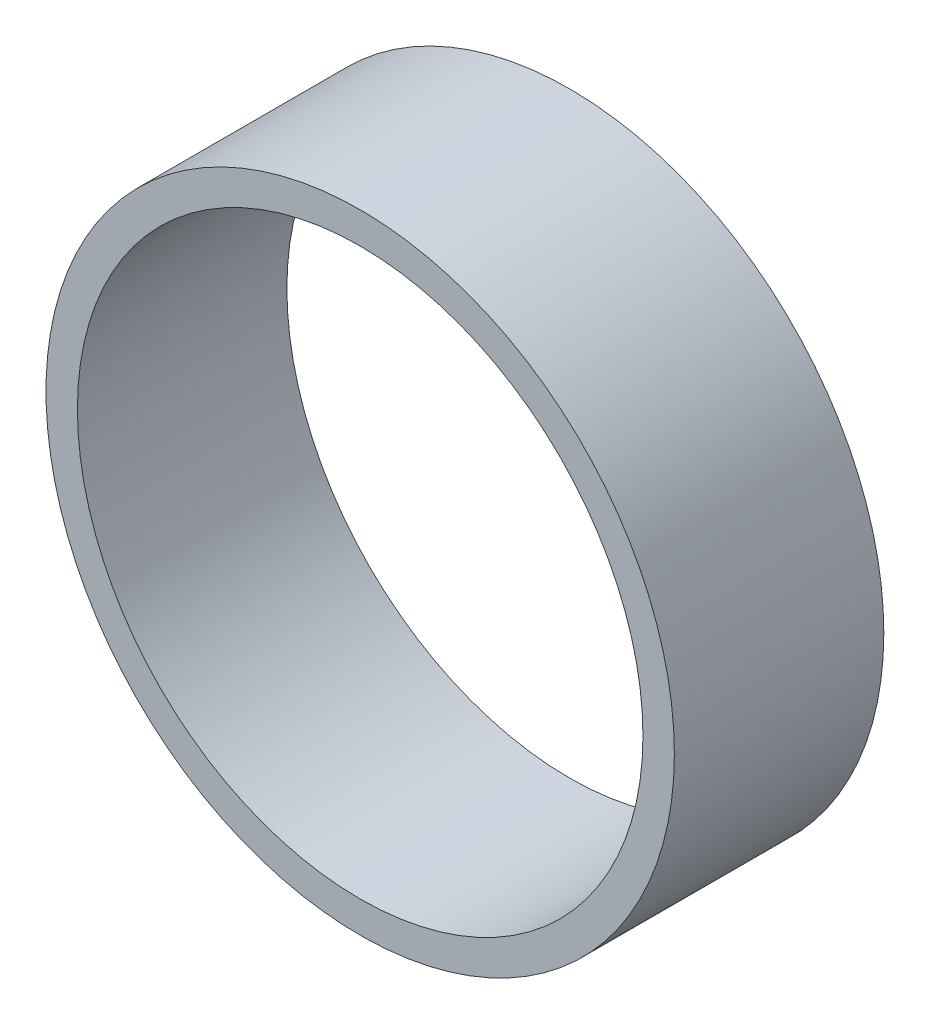
ISO-10303-21;
HEADER;
FILE_DESCRIPTION(('STEP AP214'),'2;1');
FILE_NAME('part.step','',(''),(''),'','','');
FILE_SCHEMA(('AUTOMOTIVE_DESIGN { 1 0 10303 214 1 1 1 1 }'));
ENDSEC;
DATA;
#1=APPLICATION_CONTEXT('core data for automotive mechanical design processes');
#2=APPLICATION_PROTOCOL_DEFINITION('international standard','automotive_design',2000,#1);
#3=PRODUCT_CONTEXT('',#1,'mechanical');
#4=PRODUCT('Part','Part','',(#3));
#5=PRODUCT_RELATED_PRODUCT_CATEGORY('part','',(#4));
#6=PRODUCT_DEFINITION_FORMATION('','',#4);
#7=PRODUCT_DEFINITION_CONTEXT('part definition',#1,'design');
#8=PRODUCT_DEFINITION('design','',#6,#7);
#9=PRODUCT_DEFINITION_SHAPE('','',#8);
#10=(LENGTH_UNIT() NAMED_UNIT(*) SI_UNIT(.MILLI.,.METRE.));
#11=(NAMED_UNIT(*) PLANE_ANGLE_UNIT() SI_UNIT($,.RADIAN.));
#12=(NAMED_UNIT(*) SI_UNIT($,.STERADIAN.) SOLID_ANGLE_UNIT());
#13=UNCERTAINTY_MEASURE_WITH_UNIT(LENGTH_MEASURE(1.E-05),#10,'distance_accuracy_value','');
#14=(GEOMETRIC_REPRESENTATION_CONTEXT(3) GLOBAL_UNCERTAINTY_ASSIGNED_CONTEXT((#13)) GLOBAL_UNIT_ASSIGNED_CONTEXT((#10,
#11,#12)) REPRESENTATION_CONTEXT('',''));
#15=CARTESIAN_POINT('',(0.,0.,0.));
#16=DIRECTION('',(0.,0.,1.));
#17=DIRECTION('',(1.,0.,0.));
#18=AXIS2_PLACEMENT_3D('',#15,#16,#17);
#19=CARTESIAN_POINT('',(0.,0.,20.));
#20=DIRECTION('',(0.,0.,1.));
#21=DIRECTION('',(1.,0.,0.));
#22=AXIS2_PLACEMENT_3D('',#19,#20,#21);
#23=PLANE('',#22);
#24=CARTESIAN_POINT('',(0.,0.,20.));
#25=DIRECTION('',(0.,0.,1.));
#26=DIRECTION('',(1.,0.,0.));
#27=AXIS2_PLACEMENT_3D('',#24,#25,#26);
#28=CIRCLE('',#27,30.);
#29=CARTESIAN_POINT('',(30.,0.,20.));
#30=VERTEX_POINT('',#29);
#31=EDGE_CURVE('E10',#30,#30,#28,.T.);
#32=ORIENTED_EDGE('',*,*,#31,.T.);
#33=EDGE_LOOP('',(#32));
#34=FACE_BOUND('',#33,.T.);
#35=CARTESIAN_POINT('',(0.,0.,20.));
#36=DIRECTION('',(0.,0.,1.));
#37=DIRECTION('',(1.,0.,0.));
#38=AXIS2_PLACEMENT_3D('',#35,#36,#37);
#39=CIRCLE('',#38,27.);
#40=CARTESIAN_POINT('',(27.,0.,20.));
#41=VERTEX_POINT('',#40);
#42=EDGE_CURVE('E54',#41,#41,#39,.T.);
#43=ORIENTED_EDGE('',*,*,#42,.F.);
#44=EDGE_LOOP('',(#43));
#45=FACE_BOUND('',#44,.T.);
#46=ADVANCED_FACE('F41',(#34,#45),#23,.T.);
#47=CARTESIAN_POINT('',(0.,0.,0.));
#48=DIRECTION('',(0.,0.,1.));
#49=DIRECTION('',(1.,0.,0.));
#50=AXIS2_PLACEMENT_3D('',#47,#48,#49);
#51=PLANE('',#50);
#52=CARTESIAN_POINT('',(0.,0.,0.));
#53=DIRECTION('',(0.,0.,1.));
#54=DIRECTION('',(1.,0.,0.));
#55=AXIS2_PLACEMENT_3D('',#52,#53,#54);
#56=CIRCLE('',#55,30.);
#57=CARTESIAN_POINT('',(30.,0.,0.));
#58=VERTEX_POINT('',#57);
#59=EDGE_CURVE('E45',#58,#58,#56,.T.);
#60=ORIENTED_EDGE('',*,*,#59,.F.);
#61=EDGE_LOOP('',(#60));
#62=FACE_BOUND('',#61,.T.);
#63=CARTESIAN_POINT('',(0.,0.,0.));
#64=DIRECTION('',(0.,0.,1.));
#65=DIRECTION('',(1.,0.,0.));
#66=AXIS2_PLACEMENT_3D('',#63,#64,#65);
#67=CIRCLE('',#66,27.);
#68=CARTESIAN_POINT('',(27.,0.,0.));
#69=VERTEX_POINT('',#68);
#70=EDGE_CURVE('E56',#69,#69,#67,.T.);
#71=ORIENTED_EDGE('',*,*,#70,.T.);
#72=EDGE_LOOP('',(#71));
#73=FACE_BOUND('',#72,.T.);
#74=ADVANCED_FACE('F68',(#62,#73),#51,.F.);
#75=CARTESIAN_POINT('',(0.,0.,20.));
#76=DIRECTION('',(0.,0.,-1.));
#77=DIRECTION('',(-1.,0.,0.));
#78=AXIS2_PLACEMENT_3D('',#75,#76,#77);
#79=CYLINDRICAL_SURFACE('',#78,30.);
#80=ORIENTED_EDGE('',*,*,#31,.F.);
#81=EDGE_LOOP('',(#80));
#82=FACE_BOUND('',#81,.T.);
#83=ORIENTED_EDGE('',*,*,#59,.T.);
#84=EDGE_LOOP('',(#83));
#85=FACE_BOUND('',#84,.T.);
#86=ADVANCED_FACE('F43',(#82,#85),#79,.T.);
#87=CARTESIAN_POINT('',(0.,0.,20.));
#88=DIRECTION('',(0.,0.,-1.));
#89=DIRECTION('',(-1.,0.,0.));
#90=AXIS2_PLACEMENT_3D('',#87,#88,#89);
#91=CYLINDRICAL_SURFACE('',#90,27.);
#92=ORIENTED_EDGE('',*,*,#42,.T.);
#93=EDGE_LOOP('',(#92));
#94=FACE_BOUND('',#93,.T.);
#95=ORIENTED_EDGE('',*,*,#70,.F.);
#96=EDGE_LOOP('',(#95));
#97=FACE_BOUND('',#96,.T.);
#98=ADVANCED_FACE('F64',(#94,#97),#91,.F.);
#99=CLOSED_SHELL('',(#46,#74,#86,#98));
#100=MANIFOLD_SOLID_BREP('B2',#99);
#101=ADVANCED_BREP_SHAPE_REPRESENTATION('',(#18,#100),#14);
#102=SHAPE_DEFINITION_REPRESENTATION(#9,#101);
ENDSEC;
END-ISO-10303-21;
